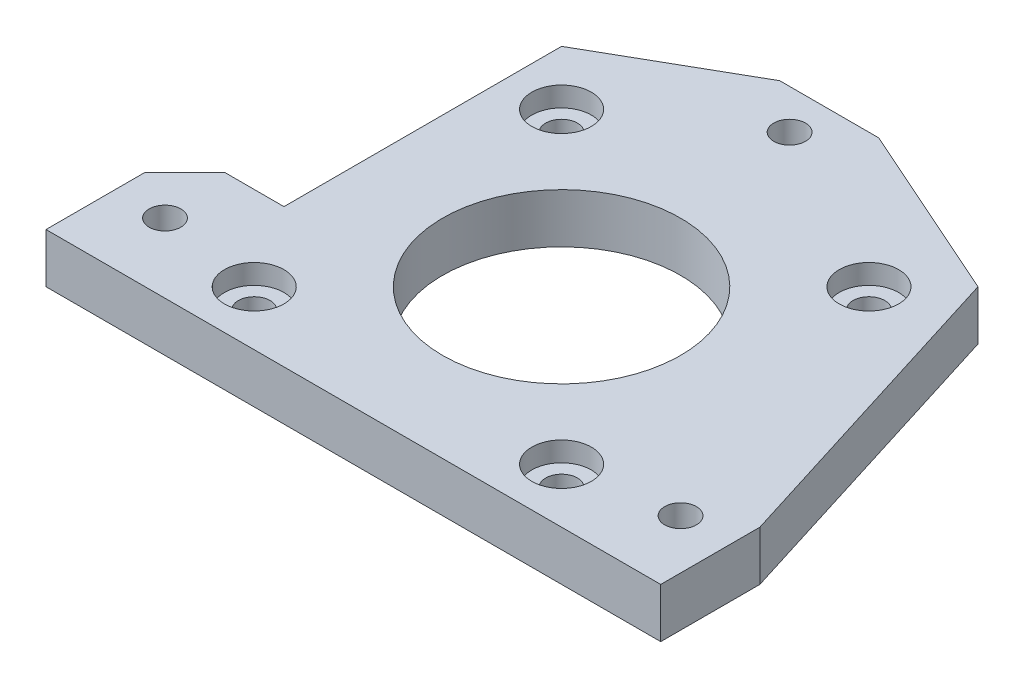
ISO-10303-21;
HEADER;
FILE_DESCRIPTION(('STEP AP214'),'2;1');
FILE_NAME('part.step','',(''),(''),'','','');
FILE_SCHEMA(('AUTOMOTIVE_DESIGN { 1 0 10303 214 1 1 1 1 }'));
ENDSEC;
DATA;
#1=APPLICATION_CONTEXT('core data for automotive mechanical design processes');
#2=APPLICATION_PROTOCOL_DEFINITION('international standard','automotive_design',2000,#1);
#3=PRODUCT_CONTEXT('',#1,'mechanical');
#4=PRODUCT('Part','Part','',(#3));
#5=PRODUCT_RELATED_PRODUCT_CATEGORY('part','',(#4));
#6=PRODUCT_DEFINITION_FORMATION('','',#4);
#7=PRODUCT_DEFINITION_CONTEXT('part definition',#1,'design');
#8=PRODUCT_DEFINITION('design','',#6,#7);
#9=PRODUCT_DEFINITION_SHAPE('','',#8);
#10=(LENGTH_UNIT() NAMED_UNIT(*) SI_UNIT(.MILLI.,.METRE.));
#11=(NAMED_UNIT(*) PLANE_ANGLE_UNIT() SI_UNIT($,.RADIAN.));
#12=(NAMED_UNIT(*) SI_UNIT($,.STERADIAN.) SOLID_ANGLE_UNIT());
#13=UNCERTAINTY_MEASURE_WITH_UNIT(LENGTH_MEASURE(1.E-05),#10,'distance_accuracy_value','');
#14=(GEOMETRIC_REPRESENTATION_CONTEXT(3) GLOBAL_UNCERTAINTY_ASSIGNED_CONTEXT((#13)) GLOBAL_UNIT_ASSIGNED_CONTEXT((#10,
#11,#12)) REPRESENTATION_CONTEXT('',''));
#15=CARTESIAN_POINT('',(0.,0.,0.));
#16=DIRECTION('',(0.,0.,1.));
#17=DIRECTION('',(1.,0.,0.));
#18=AXIS2_PLACEMENT_3D('',#15,#16,#17);
#19=CARTESIAN_POINT('',(15.5,5.,15.5));
#20=DIRECTION('',(0.,-1.,0.));
#21=DIRECTION('',(0.,0.,-1.));
#22=AXIS2_PLACEMENT_3D('',#19,#20,#21);
#23=CYLINDRICAL_SURFACE('',#22,1.6);
#24=CARTESIAN_POINT('',(15.5,0.,15.5));
#25=DIRECTION('',(0.,1.,0.));
#26=DIRECTION('',(0.,0.,1.));
#27=AXIS2_PLACEMENT_3D('',#24,#25,#26);
#28=CIRCLE('',#27,1.6);
#29=CARTESIAN_POINT('',(15.5,0.,17.1));
#30=VERTEX_POINT('',#29);
#31=EDGE_CURVE('E200',#30,#30,#28,.T.);
#32=ORIENTED_EDGE('',*,*,#31,.F.);
#33=EDGE_LOOP('',(#32));
#34=FACE_BOUND('',#33,.T.);
#35=CARTESIAN_POINT('',(15.5,3.,15.5));
#36=DIRECTION('',(0.,1.,0.));
#37=DIRECTION('',(0.,0.,1.));
#38=AXIS2_PLACEMENT_3D('',#35,#36,#37);
#39=CIRCLE('',#38,1.6);
#40=CARTESIAN_POINT('',(15.5,3.,17.1));
#41=VERTEX_POINT('',#40);
#42=EDGE_CURVE('E44',#41,#41,#39,.T.);
#43=ORIENTED_EDGE('',*,*,#42,.T.);
#44=EDGE_LOOP('',(#43));
#45=FACE_BOUND('',#44,.T.);
#46=ADVANCED_FACE('F40',(#34,#45),#23,.F.);
#47=CARTESIAN_POINT('',(-15.5,5.,15.5));
#48=DIRECTION('',(0.,-1.,0.));
#49=DIRECTION('',(0.,0.,-1.));
#50=AXIS2_PLACEMENT_3D('',#47,#48,#49);
#51=CYLINDRICAL_SURFACE('',#50,1.6);
#52=CARTESIAN_POINT('',(-15.5,0.,15.5));
#53=DIRECTION('',(0.,1.,0.));
#54=DIRECTION('',(0.,0.,1.));
#55=AXIS2_PLACEMENT_3D('',#52,#53,#54);
#56=CIRCLE('',#55,1.6);
#57=CARTESIAN_POINT('',(-15.5,0.,17.1));
#58=VERTEX_POINT('',#57);
#59=EDGE_CURVE('E197',#58,#58,#56,.T.);
#60=ORIENTED_EDGE('',*,*,#59,.F.);
#61=EDGE_LOOP('',(#60));
#62=FACE_BOUND('',#61,.T.);
#63=CARTESIAN_POINT('',(-15.5,3.,15.5));
#64=DIRECTION('',(0.,1.,0.));
#65=DIRECTION('',(0.,0.,1.));
#66=AXIS2_PLACEMENT_3D('',#63,#64,#65);
#67=CIRCLE('',#66,1.6);
#68=CARTESIAN_POINT('',(-15.5,3.,17.1));
#69=VERTEX_POINT('',#68);
#70=EDGE_CURVE('E231',#69,#69,#67,.T.);
#71=ORIENTED_EDGE('',*,*,#70,.T.);
#72=EDGE_LOOP('',(#71));
#73=FACE_BOUND('',#72,.T.);
#74=ADVANCED_FACE('F309',(#62,#73),#51,.F.);
#75=CARTESIAN_POINT('',(-15.5,5.,-15.5));
#76=DIRECTION('',(0.,-1.,0.));
#77=DIRECTION('',(0.,0.,-1.));
#78=AXIS2_PLACEMENT_3D('',#75,#76,#77);
#79=CYLINDRICAL_SURFACE('',#78,1.6);
#80=CARTESIAN_POINT('',(-15.5,0.,-15.5));
#81=DIRECTION('',(0.,1.,0.));
#82=DIRECTION('',(0.,0.,1.));
#83=AXIS2_PLACEMENT_3D('',#80,#81,#82);
#84=CIRCLE('',#83,1.6);
#85=CARTESIAN_POINT('',(-15.5,0.,-13.9));
#86=VERTEX_POINT('',#85);
#87=EDGE_CURVE('E194',#86,#86,#84,.T.);
#88=ORIENTED_EDGE('',*,*,#87,.F.);
#89=EDGE_LOOP('',(#88));
#90=FACE_BOUND('',#89,.T.);
#91=CARTESIAN_POINT('',(-15.5,3.,-15.5));
#92=DIRECTION('',(0.,1.,0.));
#93=DIRECTION('',(0.,0.,1.));
#94=AXIS2_PLACEMENT_3D('',#91,#92,#93);
#95=CIRCLE('',#94,1.6);
#96=CARTESIAN_POINT('',(-15.5,3.,-13.9));
#97=VERTEX_POINT('',#96);
#98=EDGE_CURVE('E228',#97,#97,#95,.T.);
#99=ORIENTED_EDGE('',*,*,#98,.T.);
#100=EDGE_LOOP('',(#99));
#101=FACE_BOUND('',#100,.T.);
#102=ADVANCED_FACE('F315',(#90,#101),#79,.F.);
#103=CARTESIAN_POINT('',(15.5,5.,-15.4999999999999));
#104=DIRECTION('',(0.,-1.,0.));
#105=DIRECTION('',(0.,0.,-1.));
#106=AXIS2_PLACEMENT_3D('',#103,#104,#105);
#107=CYLINDRICAL_SURFACE('',#106,1.6);
#108=CARTESIAN_POINT('',(15.5,0.,-15.4999999999999));
#109=DIRECTION('',(0.,1.,0.));
#110=DIRECTION('',(0.,0.,1.));
#111=AXIS2_PLACEMENT_3D('',#108,#109,#110);
#112=CIRCLE('',#111,1.6);
#113=CARTESIAN_POINT('',(15.5,0.,-13.8999999999999));
#114=VERTEX_POINT('',#113);
#115=EDGE_CURVE('E191',#114,#114,#112,.T.);
#116=ORIENTED_EDGE('',*,*,#115,.F.);
#117=EDGE_LOOP('',(#116));
#118=FACE_BOUND('',#117,.T.);
#119=CARTESIAN_POINT('',(15.5,3.,-15.4999999999999));
#120=DIRECTION('',(0.,1.,0.));
#121=DIRECTION('',(0.,0.,1.));
#122=AXIS2_PLACEMENT_3D('',#119,#120,#121);
#123=CIRCLE('',#122,1.6);
#124=CARTESIAN_POINT('',(15.5,3.,-13.8999999999999));
#125=VERTEX_POINT('',#124);
#126=EDGE_CURVE('E225',#125,#125,#123,.T.);
#127=ORIENTED_EDGE('',*,*,#126,.T.);
#128=EDGE_LOOP('',(#127));
#129=FACE_BOUND('',#128,.T.);
#130=ADVANCED_FACE('F325',(#118,#129),#107,.F.);
#131=CARTESIAN_POINT('',(31.,5.,0.));
#132=DIRECTION('',(-1.,0.,0.));
#133=DIRECTION('',(0.,0.,1.));
#134=AXIS2_PLACEMENT_3D('',#131,#132,#133);
#135=PLANE('',#134);
#136=DIRECTION('',(0.,0.,-1.));
#137=VECTOR('',#136,1.);
#138=CARTESIAN_POINT('',(31.,0.,0.));
#139=LINE('',#138,#137);
#140=CARTESIAN_POINT('',(31.,0.,21.));
#141=VERTEX_POINT('',#140);
#142=CARTESIAN_POINT('',(31.,0.,11.));
#143=VERTEX_POINT('',#142);
#144=EDGE_CURVE('E164',#141,#143,#139,.T.);
#145=ORIENTED_EDGE('',*,*,#144,.T.);
#146=DIRECTION('',(0.,-1.,0.));
#147=VECTOR('',#146,1.);
#148=CARTESIAN_POINT('',(31.,5.,11.));
#149=LINE('',#148,#147);
#150=CARTESIAN_POINT('',(31.,5.,11.));
#151=VERTEX_POINT('',#150);
#152=EDGE_CURVE('E11',#151,#143,#149,.T.);
#153=ORIENTED_EDGE('',*,*,#152,.F.);
#154=DIRECTION('',(0.,0.,-1.));
#155=VECTOR('',#154,1.);
#156=CARTESIAN_POINT('',(31.,5.,0.));
#157=LINE('',#156,#155);
#158=CARTESIAN_POINT('',(31.,5.,21.));
#159=VERTEX_POINT('',#158);
#160=EDGE_CURVE('E212',#159,#151,#157,.T.);
#161=ORIENTED_EDGE('',*,*,#160,.F.);
#162=DIRECTION('',(0.,-1.,0.));
#163=VECTOR('',#162,1.);
#164=CARTESIAN_POINT('',(31.,5.,21.));
#165=LINE('',#164,#163);
#166=EDGE_CURVE('E163',#159,#141,#165,.T.);
#167=ORIENTED_EDGE('',*,*,#166,.T.);
#168=EDGE_LOOP('',(#145,#153,#161,#167));
#169=FACE_BOUND('',#168,.T.);
#170=ADVANCED_FACE('F42',(#169),#135,.F.);
#171=CARTESIAN_POINT('',(25.1103202846975,5.,-7.84697508896795));
#172=DIRECTION('',(-0.95447997803503,0.,0.298274993135946));
#173=DIRECTION('',(0.298274993135946,0.,0.95447997803503));
#174=AXIS2_PLACEMENT_3D('',#171,#172,#173);
#175=PLANE('',#174);
#176=DIRECTION('',(-0.298274993135946,0.,-0.95447997803503));
#177=VECTOR('',#176,1.);
#178=CARTESIAN_POINT('',(25.1103202846975,0.,-7.84697508896795));
#179=LINE('',#178,#177);
#180=CARTESIAN_POINT('',(21.,0.,-21.));
#181=VERTEX_POINT('',#180);
#182=EDGE_CURVE('E167',#143,#181,#179,.T.);
#183=ORIENTED_EDGE('',*,*,#182,.T.);
#184=DIRECTION('',(0.,-1.,0.));
#185=VECTOR('',#184,1.);
#186=CARTESIAN_POINT('',(21.,5.,-21.));
#187=LINE('',#186,#185);
#188=CARTESIAN_POINT('',(21.,5.,-21.));
#189=VERTEX_POINT('',#188);
#190=EDGE_CURVE('E50',#189,#181,#187,.T.);
#191=ORIENTED_EDGE('',*,*,#190,.F.);
#192=DIRECTION('',(-0.298274993135946,0.,-0.95447997803503));
#193=VECTOR('',#192,1.);
#194=CARTESIAN_POINT('',(25.1103202846975,5.,-7.84697508896795));
#195=LINE('',#194,#193);
#196=EDGE_CURVE('E104',#151,#189,#195,.T.);
#197=ORIENTED_EDGE('',*,*,#196,.F.);
#198=ORIENTED_EDGE('',*,*,#152,.T.);
#199=EDGE_LOOP('',(#183,#191,#197,#198));
#200=FACE_BOUND('',#199,.T.);
#201=ADVANCED_FACE('F545',(#200),#175,.F.);
#202=CARTESIAN_POINT('',(11.2577319587629,5.,-25.3298969072165));
#203=DIRECTION('',(0.406138466053448,0.,-0.913811548620257));
#204=DIRECTION('',(-0.913811548620257,0.,-0.406138466053448));
#205=AXIS2_PLACEMENT_3D('',#202,#203,#204);
#206=PLANE('',#205);
#207=DIRECTION('',(0.913811548620257,0.,0.406138466053448));
#208=VECTOR('',#207,1.);
#209=CARTESIAN_POINT('',(11.2577319587629,0.,-25.3298969072165));
#210=LINE('',#209,#208);
#211=CARTESIAN_POINT('',(3.,0.,-29.));
#212=VERTEX_POINT('',#211);
#213=EDGE_CURVE('E170',#212,#181,#210,.T.);
#214=ORIENTED_EDGE('',*,*,#213,.F.);
#215=DIRECTION('',(0.,-1.,0.));
#216=VECTOR('',#215,1.);
#217=CARTESIAN_POINT('',(3.,5.,-29.));
#218=LINE('',#217,#216);
#219=CARTESIAN_POINT('',(3.,5.,-29.));
#220=VERTEX_POINT('',#219);
#221=EDGE_CURVE('E222',#220,#212,#218,.T.);
#222=ORIENTED_EDGE('',*,*,#221,.F.);
#223=DIRECTION('',(0.913811548620257,0.,0.406138466053448));
#224=VECTOR('',#223,1.);
#225=CARTESIAN_POINT('',(11.2577319587629,5.,-25.3298969072165));
#226=LINE('',#225,#224);
#227=EDGE_CURVE('E272',#220,#189,#226,.T.);
#228=ORIENTED_EDGE('',*,*,#227,.T.);
#229=ORIENTED_EDGE('',*,*,#190,.T.);
#230=EDGE_LOOP('',(#214,#222,#228,#229));
#231=FACE_BOUND('',#230,.T.);
#232=ADVANCED_FACE('F535',(#231),#206,.T.);
#233=CARTESIAN_POINT('',(0.,5.,-29.));
#234=DIRECTION('',(0.,0.,-1.));
#235=DIRECTION('',(-1.,0.,0.));
#236=AXIS2_PLACEMENT_3D('',#233,#234,#235);
#237=PLANE('',#236);
#238=DIRECTION('',(1.,0.,0.));
#239=VECTOR('',#238,1.);
#240=CARTESIAN_POINT('',(0.,0.,-29.));
#241=LINE('',#240,#239);
#242=CARTESIAN_POINT('',(-7.,0.,-29.));
#243=VERTEX_POINT('',#242);
#244=EDGE_CURVE('E173',#243,#212,#241,.T.);
#245=ORIENTED_EDGE('',*,*,#244,.F.);
#246=DIRECTION('',(0.,-1.,0.));
#247=VECTOR('',#246,1.);
#248=CARTESIAN_POINT('',(-7.,5.,-29.));
#249=LINE('',#248,#247);
#250=CARTESIAN_POINT('',(-7.,5.,-29.));
#251=VERTEX_POINT('',#250);
#252=EDGE_CURVE('E220',#251,#243,#249,.T.);
#253=ORIENTED_EDGE('',*,*,#252,.F.);
#254=DIRECTION('',(1.,0.,0.));
#255=VECTOR('',#254,1.);
#256=CARTESIAN_POINT('',(0.,5.,-29.));
#257=LINE('',#256,#255);
#258=EDGE_CURVE('E275',#251,#220,#257,.T.);
#259=ORIENTED_EDGE('',*,*,#258,.T.);
#260=ORIENTED_EDGE('',*,*,#221,.T.);
#261=EDGE_LOOP('',(#245,#253,#259,#260));
#262=FACE_BOUND('',#261,.T.);
#263=ADVANCED_FACE('F526',(#262),#237,.T.);
#264=CARTESIAN_POINT('',(-14.2153846153846,5.,-24.8769230769231));
#265=DIRECTION('',(-0.496138938356834,0.,-0.868243142124459));
#266=DIRECTION('',(-0.868243142124459,0.,0.496138938356834));
#267=AXIS2_PLACEMENT_3D('',#264,#265,#266);
#268=PLANE('',#267);
#269=DIRECTION('',(0.868243142124459,0.,-0.496138938356834));
#270=VECTOR('',#269,1.);
#271=CARTESIAN_POINT('',(-14.2153846153846,0.,-24.8769230769231));
#272=LINE('',#271,#270);
#273=CARTESIAN_POINT('',(-21.,0.,-21.));
#274=VERTEX_POINT('',#273);
#275=EDGE_CURVE('E176',#274,#243,#272,.T.);
#276=ORIENTED_EDGE('',*,*,#275,.F.);
#277=DIRECTION('',(0.,-1.,0.));
#278=VECTOR('',#277,1.);
#279=CARTESIAN_POINT('',(-21.,5.,-21.));
#280=LINE('',#279,#278);
#281=CARTESIAN_POINT('',(-21.,5.,-21.));
#282=VERTEX_POINT('',#281);
#283=EDGE_CURVE('E218',#282,#274,#280,.T.);
#284=ORIENTED_EDGE('',*,*,#283,.F.);
#285=DIRECTION('',(0.868243142124459,0.,-0.496138938356834));
#286=VECTOR('',#285,1.);
#287=CARTESIAN_POINT('',(-14.2153846153846,5.,-24.8769230769231));
#288=LINE('',#287,#286);
#289=EDGE_CURVE('E278',#282,#251,#288,.T.);
#290=ORIENTED_EDGE('',*,*,#289,.T.);
#291=ORIENTED_EDGE('',*,*,#252,.T.);
#292=EDGE_LOOP('',(#276,#284,#290,#291));
#293=FACE_BOUND('',#292,.T.);
#294=ADVANCED_FACE('F291',(#293),#268,.T.);
#295=CARTESIAN_POINT('',(-21.,5.,0.));
#296=DIRECTION('',(-1.,0.,0.));
#297=DIRECTION('',(0.,0.,1.));
#298=AXIS2_PLACEMENT_3D('',#295,#296,#297);
#299=PLANE('',#298);
#300=DIRECTION('',(0.,0.,-1.));
#301=VECTOR('',#300,1.);
#302=CARTESIAN_POINT('',(-21.,0.,0.));
#303=LINE('',#302,#301);
#304=CARTESIAN_POINT('',(-21.,0.,7.));
#305=VERTEX_POINT('',#304);
#306=EDGE_CURVE('E179',#305,#274,#303,.T.);
#307=ORIENTED_EDGE('',*,*,#306,.F.);
#308=DIRECTION('',(0.,-1.,0.));
#309=VECTOR('',#308,1.);
#310=CARTESIAN_POINT('',(-21.,5.,7.));
#311=LINE('',#310,#309);
#312=CARTESIAN_POINT('',(-21.,5.,7.));
#313=VERTEX_POINT('',#312);
#314=EDGE_CURVE('E216',#313,#305,#311,.T.);
#315=ORIENTED_EDGE('',*,*,#314,.F.);
#316=DIRECTION('',(0.,0.,-1.));
#317=VECTOR('',#316,1.);
#318=CARTESIAN_POINT('',(-21.,5.,0.));
#319=LINE('',#318,#317);
#320=EDGE_CURVE('E281',#313,#282,#319,.T.);
#321=ORIENTED_EDGE('',*,*,#320,.T.);
#322=ORIENTED_EDGE('',*,*,#283,.T.);
#323=EDGE_LOOP('',(#307,#315,#321,#322));
#324=FACE_BOUND('',#323,.T.);
#325=ADVANCED_FACE('F285',(#324),#299,.T.);
#326=CARTESIAN_POINT('',(0.,5.,7.));
#327=DIRECTION('',(0.,0.,1.));
#328=DIRECTION('',(1.,0.,0.));
#329=AXIS2_PLACEMENT_3D('',#326,#327,#328);
#330=PLANE('',#329);
#331=DIRECTION('',(-1.,0.,0.));
#332=VECTOR('',#331,1.);
#333=CARTESIAN_POINT('',(0.,0.,7.));
#334=LINE('',#333,#332);
#335=CARTESIAN_POINT('',(-27.,0.,7.00000000000001));
#336=VERTEX_POINT('',#335);
#337=EDGE_CURVE('E182',#305,#336,#334,.T.);
#338=ORIENTED_EDGE('',*,*,#337,.T.);
#339=DIRECTION('',(0.,-1.,0.));
#340=VECTOR('',#339,1.);
#341=CARTESIAN_POINT('',(-27.,5.,7.00000000000001));
#342=LINE('',#341,#340);
#343=CARTESIAN_POINT('',(-27.,5.,7.00000000000001));
#344=VERTEX_POINT('',#343);
#345=EDGE_CURVE('E144',#344,#336,#342,.T.);
#346=ORIENTED_EDGE('',*,*,#345,.F.);
#347=DIRECTION('',(-1.,0.,0.));
#348=VECTOR('',#347,1.);
#349=CARTESIAN_POINT('',(0.,5.,7.));
#350=LINE('',#349,#348);
#351=EDGE_CURVE('E131',#313,#344,#350,.T.);
#352=ORIENTED_EDGE('',*,*,#351,.F.);
#353=ORIENTED_EDGE('',*,*,#314,.T.);
#354=EDGE_LOOP('',(#338,#346,#352,#353));
#355=FACE_BOUND('',#354,.T.);
#356=ADVANCED_FACE('F299',(#355),#330,.F.);
#357=CARTESIAN_POINT('',(-10.,5.,-10.));
#358=DIRECTION('',(0.707106781186548,0.,0.707106781186547));
#359=DIRECTION('',(0.707106781186547,0.,-0.707106781186548));
#360=AXIS2_PLACEMENT_3D('',#357,#358,#359);
#361=PLANE('',#360);
#362=DIRECTION('',(-0.707106781186547,0.,0.707106781186548));
#363=VECTOR('',#362,1.);
#364=CARTESIAN_POINT('',(-10.,0.,-10.));
#365=LINE('',#364,#363);
#366=CARTESIAN_POINT('',(-31.,0.,11.));
#367=VERTEX_POINT('',#366);
#368=EDGE_CURVE('E140',#336,#367,#365,.T.);
#369=ORIENTED_EDGE('',*,*,#368,.T.);
#370=DIRECTION('',(0.,-1.,0.));
#371=VECTOR('',#370,1.);
#372=CARTESIAN_POINT('',(-31.,5.,11.));
#373=LINE('',#372,#371);
#374=CARTESIAN_POINT('',(-31.,5.,11.));
#375=VERTEX_POINT('',#374);
#376=EDGE_CURVE('E137',#375,#367,#373,.T.);
#377=ORIENTED_EDGE('',*,*,#376,.F.);
#378=DIRECTION('',(-0.707106781186547,0.,0.707106781186548));
#379=VECTOR('',#378,1.);
#380=CARTESIAN_POINT('',(-10.,5.,-10.));
#381=LINE('',#380,#379);
#382=EDGE_CURVE('E123',#344,#375,#381,.T.);
#383=ORIENTED_EDGE('',*,*,#382,.F.);
#384=ORIENTED_EDGE('',*,*,#345,.T.);
#385=EDGE_LOOP('',(#369,#377,#383,#384));
#386=FACE_BOUND('',#385,.T.);
#387=ADVANCED_FACE('F138',(#386),#361,.F.);
#388=CARTESIAN_POINT('',(-31.,5.,0.));
#389=DIRECTION('',(-1.,0.,0.));
#390=DIRECTION('',(0.,0.,1.));
#391=AXIS2_PLACEMENT_3D('',#388,#389,#390);
#392=PLANE('',#391);
#393=DIRECTION('',(0.,0.,-1.));
#394=VECTOR('',#393,1.);
#395=CARTESIAN_POINT('',(-31.,0.,0.));
#396=LINE('',#395,#394);
#397=CARTESIAN_POINT('',(-31.,0.,21.));
#398=VERTEX_POINT('',#397);
#399=EDGE_CURVE('E185',#398,#367,#396,.T.);
#400=ORIENTED_EDGE('',*,*,#399,.F.);
#401=DIRECTION('',(0.,-1.,0.));
#402=VECTOR('',#401,1.);
#403=CARTESIAN_POINT('',(-31.,5.,21.));
#404=LINE('',#403,#402);
#405=CARTESIAN_POINT('',(-31.,5.,21.));
#406=VERTEX_POINT('',#405);
#407=EDGE_CURVE('E93',#406,#398,#404,.T.);
#408=ORIENTED_EDGE('',*,*,#407,.F.);
#409=DIRECTION('',(0.,0.,-1.));
#410=VECTOR('',#409,1.);
#411=CARTESIAN_POINT('',(-31.,5.,0.));
#412=LINE('',#411,#410);
#413=EDGE_CURVE('E128',#406,#375,#412,.T.);
#414=ORIENTED_EDGE('',*,*,#413,.T.);
#415=ORIENTED_EDGE('',*,*,#376,.T.);
#416=EDGE_LOOP('',(#400,#408,#414,#415));
#417=FACE_BOUND('',#416,.T.);
#418=ADVANCED_FACE('F146',(#417),#392,.T.);
#419=CARTESIAN_POINT('',(-2.00000000000001,5.,-25.));
#420=DIRECTION('',(0.,-1.,0.));
#421=DIRECTION('',(0.,0.,-1.));
#422=AXIS2_PLACEMENT_3D('',#419,#420,#421);
#423=CYLINDRICAL_SURFACE('',#422,1.6);
#424=CARTESIAN_POINT('',(-2.00000000000001,5.,-25.));
#425=DIRECTION('',(0.,1.,0.));
#426=DIRECTION('',(0.,0.,1.));
#427=AXIS2_PLACEMENT_3D('',#424,#425,#426);
#428=CIRCLE('',#427,1.6);
#429=CARTESIAN_POINT('',(-2.00000000000001,5.,-23.4));
#430=VERTEX_POINT('',#429);
#431=EDGE_CURVE('E157',#430,#430,#428,.T.);
#432=ORIENTED_EDGE('',*,*,#431,.T.);
#433=EDGE_LOOP('',(#432));
#434=FACE_BOUND('',#433,.T.);
#435=CARTESIAN_POINT('',(-2.00000000000001,0.,-25.));
#436=DIRECTION('',(0.,1.,0.));
#437=DIRECTION('',(0.,0.,1.));
#438=AXIS2_PLACEMENT_3D('',#435,#436,#437);
#439=CIRCLE('',#438,1.6);
#440=CARTESIAN_POINT('',(-2.00000000000001,0.,-23.4));
#441=VERTEX_POINT('',#440);
#442=EDGE_CURVE('E206',#441,#441,#439,.T.);
#443=ORIENTED_EDGE('',*,*,#442,.F.);
#444=EDGE_LOOP('',(#443));
#445=FACE_BOUND('',#444,.T.);
#446=ADVANCED_FACE('F339',(#434,#445),#423,.F.);
#447=CARTESIAN_POINT('',(-26.,5.,14.));
#448=DIRECTION('',(0.,-1.,0.));
#449=DIRECTION('',(0.,0.,-1.));
#450=AXIS2_PLACEMENT_3D('',#447,#448,#449);
#451=CYLINDRICAL_SURFACE('',#450,1.6);
#452=CARTESIAN_POINT('',(-26.,5.,14.));
#453=DIRECTION('',(0.,1.,0.));
#454=DIRECTION('',(0.,0.,1.));
#455=AXIS2_PLACEMENT_3D('',#452,#453,#454);
#456=CIRCLE('',#455,1.6);
#457=CARTESIAN_POINT('',(-26.,5.,15.6));
#458=VERTEX_POINT('',#457);
#459=EDGE_CURVE('E154',#458,#458,#456,.T.);
#460=ORIENTED_EDGE('',*,*,#459,.T.);
#461=EDGE_LOOP('',(#460));
#462=FACE_BOUND('',#461,.T.);
#463=CARTESIAN_POINT('',(-26.,0.,14.));
#464=DIRECTION('',(0.,1.,0.));
#465=DIRECTION('',(0.,0.,1.));
#466=AXIS2_PLACEMENT_3D('',#463,#464,#465);
#467=CIRCLE('',#466,1.6);
#468=CARTESIAN_POINT('',(-26.,0.,15.6));
#469=VERTEX_POINT('',#468);
#470=EDGE_CURVE('E203',#469,#469,#467,.T.);
#471=ORIENTED_EDGE('',*,*,#470,.F.);
#472=EDGE_LOOP('',(#471));
#473=FACE_BOUND('',#472,.T.);
#474=ADVANCED_FACE('F320',(#462,#473),#451,.F.);
#475=CARTESIAN_POINT('',(0.,5.,0.));
#476=DIRECTION('',(0.,-1.,0.));
#477=DIRECTION('',(0.,0.,-1.));
#478=AXIS2_PLACEMENT_3D('',#475,#476,#477);
#479=CYLINDRICAL_SURFACE('',#478,12.);
#480=CARTESIAN_POINT('',(0.,5.,0.));
#481=DIRECTION('',(0.,1.,0.));
#482=DIRECTION('',(0.,0.,1.));
#483=AXIS2_PLACEMENT_3D('',#480,#481,#482);
#484=CIRCLE('',#483,12.);
#485=CARTESIAN_POINT('',(0.,5.,12.));
#486=VERTEX_POINT('',#485);
#487=EDGE_CURVE('E148',#486,#486,#484,.T.);
#488=ORIENTED_EDGE('',*,*,#487,.T.);
#489=EDGE_LOOP('',(#488));
#490=FACE_BOUND('',#489,.T.);
#491=CARTESIAN_POINT('',(0.,0.,0.));
#492=DIRECTION('',(0.,1.,0.));
#493=DIRECTION('',(0.,0.,1.));
#494=AXIS2_PLACEMENT_3D('',#491,#492,#493);
#495=CIRCLE('',#494,12.);
#496=CARTESIAN_POINT('',(0.,0.,12.));
#497=VERTEX_POINT('',#496);
#498=EDGE_CURVE('E188',#497,#497,#495,.T.);
#499=ORIENTED_EDGE('',*,*,#498,.F.);
#500=EDGE_LOOP('',(#499));
#501=FACE_BOUND('',#500,.T.);
#502=ADVANCED_FACE('F330',(#490,#501),#479,.F.);
#503=CARTESIAN_POINT('',(0.,5.,21.));
#504=DIRECTION('',(0.,0.,-1.));
#505=DIRECTION('',(-1.,0.,0.));
#506=AXIS2_PLACEMENT_3D('',#503,#504,#505);
#507=PLANE('',#506);
#508=DIRECTION('',(1.,0.,0.));
#509=VECTOR('',#508,1.);
#510=CARTESIAN_POINT('',(0.,0.,21.));
#511=LINE('',#510,#509);
#512=EDGE_CURVE('E96',#398,#141,#511,.T.);
#513=ORIENTED_EDGE('',*,*,#512,.T.);
#514=ORIENTED_EDGE('',*,*,#166,.F.);
#515=DIRECTION('',(1.,0.,0.));
#516=VECTOR('',#515,1.);
#517=CARTESIAN_POINT('',(0.,5.,21.));
#518=LINE('',#517,#516);
#519=EDGE_CURVE('E59',#406,#159,#518,.T.);
#520=ORIENTED_EDGE('',*,*,#519,.F.);
#521=ORIENTED_EDGE('',*,*,#407,.T.);
#522=EDGE_LOOP('',(#513,#514,#520,#521));
#523=FACE_BOUND('',#522,.T.);
#524=ADVANCED_FACE('F333',(#523),#507,.F.);
#525=CARTESIAN_POINT('',(26.,5.,14.));
#526=DIRECTION('',(0.,-1.,0.));
#527=DIRECTION('',(0.,0.,-1.));
#528=AXIS2_PLACEMENT_3D('',#525,#526,#527);
#529=CYLINDRICAL_SURFACE('',#528,1.6);
#530=CARTESIAN_POINT('',(26.,5.,14.));
#531=DIRECTION('',(0.,1.,0.));
#532=DIRECTION('',(0.,0.,1.));
#533=AXIS2_PLACEMENT_3D('',#530,#531,#532);
#534=CIRCLE('',#533,1.6);
#535=CARTESIAN_POINT('',(26.,5.,15.6));
#536=VERTEX_POINT('',#535);
#537=EDGE_CURVE('E160',#536,#536,#534,.F.);
#538=ORIENTED_EDGE('',*,*,#537,.F.);
#539=EDGE_LOOP('',(#538));
#540=FACE_BOUND('',#539,.T.);
#541=CARTESIAN_POINT('',(26.,0.,14.));
#542=DIRECTION('',(0.,1.,0.));
#543=DIRECTION('',(0.,0.,1.));
#544=AXIS2_PLACEMENT_3D('',#541,#542,#543);
#545=CIRCLE('',#544,1.6);
#546=CARTESIAN_POINT('',(26.,0.,15.6));
#547=VERTEX_POINT('',#546);
#548=EDGE_CURVE('E209',#547,#547,#545,.F.);
#549=ORIENTED_EDGE('',*,*,#548,.T.);
#550=EDGE_LOOP('',(#549));
#551=FACE_BOUND('',#550,.T.);
#552=ADVANCED_FACE('F337',(#540,#551),#529,.F.);
#553=CARTESIAN_POINT('',(0.,5.,0.));
#554=DIRECTION('',(0.,1.,0.));
#555=DIRECTION('',(0.,0.,1.));
#556=AXIS2_PLACEMENT_3D('',#553,#554,#555);
#557=PLANE('',#556);
#558=CARTESIAN_POINT('',(-15.5,5.,15.5));
#559=DIRECTION('',(0.,1.,0.));
#560=DIRECTION('',(0.,0.,1.));
#561=AXIS2_PLACEMENT_3D('',#558,#559,#560);
#562=CIRCLE('',#561,3.);
#563=CARTESIAN_POINT('',(-15.5,5.,18.5));
#564=VERTEX_POINT('',#563);
#565=EDGE_CURVE('E262',#564,#564,#562,.T.);
#566=ORIENTED_EDGE('',*,*,#565,.F.);
#567=EDGE_LOOP('',(#566));
#568=FACE_BOUND('',#567,.T.);
#569=CARTESIAN_POINT('',(15.5,5.,15.5));
#570=DIRECTION('',(0.,1.,0.));
#571=DIRECTION('',(0.,0.,1.));
#572=AXIS2_PLACEMENT_3D('',#569,#570,#571);
#573=CIRCLE('',#572,3.);
#574=CARTESIAN_POINT('',(15.5,5.,18.5));
#575=VERTEX_POINT('',#574);
#576=EDGE_CURVE('E250',#575,#575,#573,.T.);
#577=ORIENTED_EDGE('',*,*,#576,.F.);
#578=EDGE_LOOP('',(#577));
#579=FACE_BOUND('',#578,.T.);
#580=CARTESIAN_POINT('',(15.5,5.,-15.4999999999999));
#581=DIRECTION('',(0.,1.,0.));
#582=DIRECTION('',(0.,0.,1.));
#583=AXIS2_PLACEMENT_3D('',#580,#581,#582);
#584=CIRCLE('',#583,3.);
#585=CARTESIAN_POINT('',(15.5,5.,-12.4999999999999));
#586=VERTEX_POINT('',#585);
#587=EDGE_CURVE('E249',#586,#586,#584,.T.);
#588=ORIENTED_EDGE('',*,*,#587,.F.);
#589=EDGE_LOOP('',(#588));
#590=FACE_BOUND('',#589,.T.);
#591=CARTESIAN_POINT('',(-15.5,5.,-15.5));
#592=DIRECTION('',(0.,1.,0.));
#593=DIRECTION('',(0.,0.,1.));
#594=AXIS2_PLACEMENT_3D('',#591,#592,#593);
#595=CIRCLE('',#594,3.);
#596=CARTESIAN_POINT('',(-15.5,5.,-12.5));
#597=VERTEX_POINT('',#596);
#598=EDGE_CURVE('E267',#597,#597,#595,.T.);
#599=ORIENTED_EDGE('',*,*,#598,.F.);
#600=EDGE_LOOP('',(#599));
#601=FACE_BOUND('',#600,.T.);
#602=ORIENTED_EDGE('',*,*,#160,.T.);
#603=ORIENTED_EDGE('',*,*,#196,.T.);
#604=ORIENTED_EDGE('',*,*,#227,.F.);
#605=ORIENTED_EDGE('',*,*,#258,.F.);
#606=ORIENTED_EDGE('',*,*,#289,.F.);
#607=ORIENTED_EDGE('',*,*,#320,.F.);
#608=ORIENTED_EDGE('',*,*,#351,.T.);
#609=ORIENTED_EDGE('',*,*,#382,.T.);
#610=ORIENTED_EDGE('',*,*,#413,.F.);
#611=ORIENTED_EDGE('',*,*,#519,.T.);
#612=EDGE_LOOP('',(#602,#603,#604,#605,#606,#607,#608,#609,#610,#611));
#613=FACE_BOUND('',#612,.T.);
#614=ORIENTED_EDGE('',*,*,#487,.F.);
#615=EDGE_LOOP('',(#614));
#616=FACE_BOUND('',#615,.T.);
#617=ORIENTED_EDGE('',*,*,#459,.F.);
#618=EDGE_LOOP('',(#617));
#619=FACE_BOUND('',#618,.T.);
#620=ORIENTED_EDGE('',*,*,#431,.F.);
#621=EDGE_LOOP('',(#620));
#622=FACE_BOUND('',#621,.T.);
#623=ORIENTED_EDGE('',*,*,#537,.T.);
#624=EDGE_LOOP('',(#623));
#625=FACE_BOUND('',#624,.T.);
#626=ADVANCED_FACE('F125',(#568,#579,#590,#601,#613,#616,#619,#622,#625),#557,.T.);
#627=CARTESIAN_POINT('',(0.,0.,0.));
#628=DIRECTION('',(0.,1.,0.));
#629=DIRECTION('',(0.,0.,1.));
#630=AXIS2_PLACEMENT_3D('',#627,#628,#629);
#631=PLANE('',#630);
#632=ORIENTED_EDGE('',*,*,#144,.F.);
#633=ORIENTED_EDGE('',*,*,#512,.F.);
#634=ORIENTED_EDGE('',*,*,#399,.T.);
#635=ORIENTED_EDGE('',*,*,#368,.F.);
#636=ORIENTED_EDGE('',*,*,#337,.F.);
#637=ORIENTED_EDGE('',*,*,#306,.T.);
#638=ORIENTED_EDGE('',*,*,#275,.T.);
#639=ORIENTED_EDGE('',*,*,#244,.T.);
#640=ORIENTED_EDGE('',*,*,#213,.T.);
#641=ORIENTED_EDGE('',*,*,#182,.F.);
#642=EDGE_LOOP('',(#632,#633,#634,#635,#636,#637,#638,#639,#640,#641));
#643=FACE_BOUND('',#642,.T.);
#644=ORIENTED_EDGE('',*,*,#498,.T.);
#645=EDGE_LOOP('',(#644));
#646=FACE_BOUND('',#645,.T.);
#647=ORIENTED_EDGE('',*,*,#115,.T.);
#648=EDGE_LOOP('',(#647));
#649=FACE_BOUND('',#648,.T.);
#650=ORIENTED_EDGE('',*,*,#87,.T.);
#651=EDGE_LOOP('',(#650));
#652=FACE_BOUND('',#651,.T.);
#653=ORIENTED_EDGE('',*,*,#59,.T.);
#654=EDGE_LOOP('',(#653));
#655=FACE_BOUND('',#654,.T.);
#656=ORIENTED_EDGE('',*,*,#31,.T.);
#657=EDGE_LOOP('',(#656));
#658=FACE_BOUND('',#657,.T.);
#659=ORIENTED_EDGE('',*,*,#470,.T.);
#660=EDGE_LOOP('',(#659));
#661=FACE_BOUND('',#660,.T.);
#662=ORIENTED_EDGE('',*,*,#442,.T.);
#663=EDGE_LOOP('',(#662));
#664=FACE_BOUND('',#663,.T.);
#665=ORIENTED_EDGE('',*,*,#548,.F.);
#666=EDGE_LOOP('',(#665));
#667=FACE_BOUND('',#666,.T.);
#668=ADVANCED_FACE('F296',(#643,#646,#649,#652,#655,#658,#661,#664,#667),#631,.F.);
#669=CARTESIAN_POINT('',(-15.5,3.,-15.5));
#670=DIRECTION('',(0.,1.,0.));
#671=DIRECTION('',(0.,0.,1.));
#672=AXIS2_PLACEMENT_3D('',#669,#670,#671);
#673=CYLINDRICAL_SURFACE('',#672,3.);
#674=CARTESIAN_POINT('',(-15.5,3.,-15.5));
#675=DIRECTION('',(0.,1.,0.));
#676=DIRECTION('',(0.,0.,1.));
#677=AXIS2_PLACEMENT_3D('',#674,#675,#676);
#678=CIRCLE('',#677,3.);
#679=CARTESIAN_POINT('',(-15.5,3.,-12.5));
#680=VERTEX_POINT('',#679);
#681=EDGE_CURVE('E229',#680,#680,#678,.T.);
#682=ORIENTED_EDGE('',*,*,#681,.F.);
#683=EDGE_LOOP('',(#682));
#684=FACE_BOUND('',#683,.T.);
#685=ORIENTED_EDGE('',*,*,#598,.T.);
#686=EDGE_LOOP('',(#685));
#687=FACE_BOUND('',#686,.T.);
#688=ADVANCED_FACE('F355',(#684,#687),#673,.F.);
#689=CARTESIAN_POINT('',(-15.5,3.,-15.5));
#690=DIRECTION('',(0.,1.,0.));
#691=DIRECTION('',(0.,0.,1.));
#692=AXIS2_PLACEMENT_3D('',#689,#690,#691);
#693=PLANE('',#692);
#694=ORIENTED_EDGE('',*,*,#98,.F.);
#695=EDGE_LOOP('',(#694));
#696=FACE_BOUND('',#695,.T.);
#697=ORIENTED_EDGE('',*,*,#681,.T.);
#698=EDGE_LOOP('',(#697));
#699=FACE_BOUND('',#698,.T.);
#700=ADVANCED_FACE('F361',(#696,#699),#693,.T.);
#701=CARTESIAN_POINT('',(15.5,3.,-15.4999999999999));
#702=DIRECTION('',(0.,1.,0.));
#703=DIRECTION('',(0.,0.,1.));
#704=AXIS2_PLACEMENT_3D('',#701,#702,#703);
#705=CYLINDRICAL_SURFACE('',#704,3.);
#706=CARTESIAN_POINT('',(15.5,3.,-15.4999999999999));
#707=DIRECTION('',(0.,1.,0.));
#708=DIRECTION('',(0.,0.,1.));
#709=AXIS2_PLACEMENT_3D('',#706,#707,#708);
#710=CIRCLE('',#709,3.);
#711=CARTESIAN_POINT('',(15.5,3.,-12.4999999999999));
#712=VERTEX_POINT('',#711);
#713=EDGE_CURVE('E253',#712,#712,#710,.T.);
#714=ORIENTED_EDGE('',*,*,#713,.F.);
#715=EDGE_LOOP('',(#714));
#716=FACE_BOUND('',#715,.T.);
#717=ORIENTED_EDGE('',*,*,#587,.T.);
#718=EDGE_LOOP('',(#717));
#719=FACE_BOUND('',#718,.T.);
#720=ADVANCED_FACE('F365',(#716,#719),#705,.F.);
#721=CARTESIAN_POINT('',(15.5,3.,-15.4999999999999));
#722=DIRECTION('',(0.,1.,0.));
#723=DIRECTION('',(0.,0.,1.));
#724=AXIS2_PLACEMENT_3D('',#721,#722,#723);
#725=PLANE('',#724);
#726=ORIENTED_EDGE('',*,*,#126,.F.);
#727=EDGE_LOOP('',(#726));
#728=FACE_BOUND('',#727,.T.);
#729=ORIENTED_EDGE('',*,*,#713,.T.);
#730=EDGE_LOOP('',(#729));
#731=FACE_BOUND('',#730,.T.);
#732=ADVANCED_FACE('F375',(#728,#731),#725,.T.);
#733=CARTESIAN_POINT('',(15.5,3.,15.5));
#734=DIRECTION('',(0.,1.,0.));
#735=DIRECTION('',(0.,0.,1.));
#736=AXIS2_PLACEMENT_3D('',#733,#734,#735);
#737=CYLINDRICAL_SURFACE('',#736,3.);
#738=CARTESIAN_POINT('',(15.5,3.,15.5));
#739=DIRECTION('',(0.,1.,0.));
#740=DIRECTION('',(0.,0.,1.));
#741=AXIS2_PLACEMENT_3D('',#738,#739,#740);
#742=CIRCLE('',#741,3.);
#743=CARTESIAN_POINT('',(15.5,3.,18.5));
#744=VERTEX_POINT('',#743);
#745=EDGE_CURVE('E247',#744,#744,#742,.T.);
#746=ORIENTED_EDGE('',*,*,#745,.F.);
#747=EDGE_LOOP('',(#746));
#748=FACE_BOUND('',#747,.T.);
#749=ORIENTED_EDGE('',*,*,#576,.T.);
#750=EDGE_LOOP('',(#749));
#751=FACE_BOUND('',#750,.T.);
#752=ADVANCED_FACE('F243',(#748,#751),#737,.F.);
#753=CARTESIAN_POINT('',(15.5,3.,15.5));
#754=DIRECTION('',(0.,1.,0.));
#755=DIRECTION('',(0.,0.,1.));
#756=AXIS2_PLACEMENT_3D('',#753,#754,#755);
#757=PLANE('',#756);
#758=ORIENTED_EDGE('',*,*,#42,.F.);
#759=EDGE_LOOP('',(#758));
#760=FACE_BOUND('',#759,.T.);
#761=ORIENTED_EDGE('',*,*,#745,.T.);
#762=EDGE_LOOP('',(#761));
#763=FACE_BOUND('',#762,.T.);
#764=ADVANCED_FACE('F239',(#760,#763),#757,.T.);
#765=CARTESIAN_POINT('',(-15.5,3.,15.5));
#766=DIRECTION('',(0.,1.,0.));
#767=DIRECTION('',(0.,0.,1.));
#768=AXIS2_PLACEMENT_3D('',#765,#766,#767);
#769=CYLINDRICAL_SURFACE('',#768,3.);
#770=CARTESIAN_POINT('',(-15.5,3.,15.5));
#771=DIRECTION('',(0.,1.,0.));
#772=DIRECTION('',(0.,0.,1.));
#773=AXIS2_PLACEMENT_3D('',#770,#771,#772);
#774=CIRCLE('',#773,3.);
#775=CARTESIAN_POINT('',(-15.5,3.,18.5));
#776=VERTEX_POINT('',#775);
#777=EDGE_CURVE('E256',#776,#776,#774,.T.);
#778=ORIENTED_EDGE('',*,*,#777,.F.);
#779=EDGE_LOOP('',(#778));
#780=FACE_BOUND('',#779,.T.);
#781=ORIENTED_EDGE('',*,*,#565,.T.);
#782=EDGE_LOOP('',(#781));
#783=FACE_BOUND('',#782,.T.);
#784=ADVANCED_FACE('F242',(#780,#783),#769,.F.);
#785=CARTESIAN_POINT('',(-15.5,3.,15.5));
#786=DIRECTION('',(0.,1.,0.));
#787=DIRECTION('',(0.,0.,1.));
#788=AXIS2_PLACEMENT_3D('',#785,#786,#787);
#789=PLANE('',#788);
#790=ORIENTED_EDGE('',*,*,#70,.F.);
#791=EDGE_LOOP('',(#790));
#792=FACE_BOUND('',#791,.T.);
#793=ORIENTED_EDGE('',*,*,#777,.T.);
#794=EDGE_LOOP('',(#793));
#795=FACE_BOUND('',#794,.T.);
#796=ADVANCED_FACE('F369',(#792,#795),#789,.T.);
#797=CLOSED_SHELL('',(#46,#74,#102,#130,#170,#201,#232,#263,#294,#325,#356,#387,#418,#446,#474,
#502,#524,#552,#626,#668,#688,#700,#720,#732,#752,#764,#784,#796));
#798=MANIFOLD_SOLID_BREP('B2',#797);
#799=ADVANCED_BREP_SHAPE_REPRESENTATION('',(#18,#798),#14);
#800=SHAPE_DEFINITION_REPRESENTATION(#9,#799);
ENDSEC;
END-ISO-10303-21;
